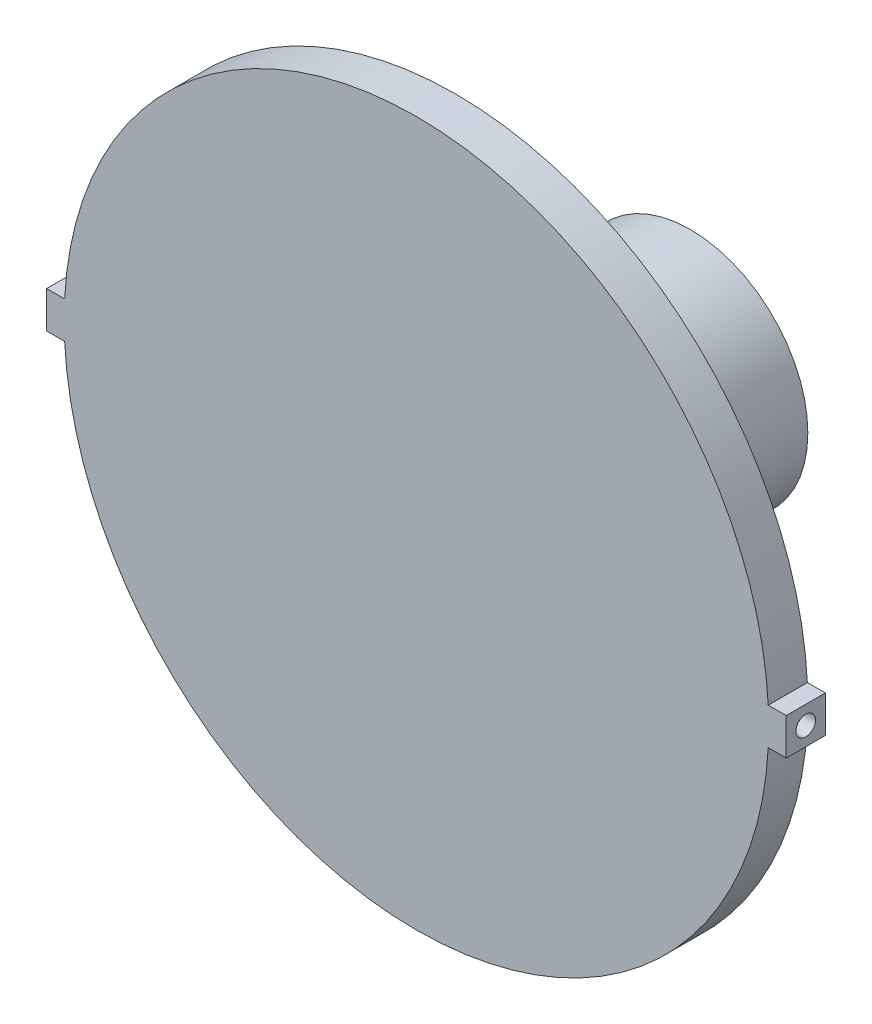
ISO-10303-21;
HEADER;
FILE_DESCRIPTION(('STEP AP214'),'2;1');
FILE_NAME('part.step','',(''),(''),'','','');
FILE_SCHEMA(('AUTOMOTIVE_DESIGN { 1 0 10303 214 1 1 1 1 }'));
ENDSEC;
DATA;
#1=APPLICATION_CONTEXT('core data for automotive mechanical design processes');
#2=APPLICATION_PROTOCOL_DEFINITION('international standard','automotive_design',2000,#1);
#3=PRODUCT_CONTEXT('',#1,'mechanical');
#4=PRODUCT('Part','Part','',(#3));
#5=PRODUCT_RELATED_PRODUCT_CATEGORY('part','',(#4));
#6=PRODUCT_DEFINITION_FORMATION('','',#4);
#7=PRODUCT_DEFINITION_CONTEXT('part definition',#1,'design');
#8=PRODUCT_DEFINITION('design','',#6,#7);
#9=PRODUCT_DEFINITION_SHAPE('','',#8);
#10=(LENGTH_UNIT() NAMED_UNIT(*) SI_UNIT(.MILLI.,.METRE.));
#11=(NAMED_UNIT(*) PLANE_ANGLE_UNIT() SI_UNIT($,.RADIAN.));
#12=(NAMED_UNIT(*) SI_UNIT($,.STERADIAN.) SOLID_ANGLE_UNIT());
#13=UNCERTAINTY_MEASURE_WITH_UNIT(LENGTH_MEASURE(1.E-05),#10,'distance_accuracy_value','');
#14=(GEOMETRIC_REPRESENTATION_CONTEXT(3) GLOBAL_UNCERTAINTY_ASSIGNED_CONTEXT((#13)) GLOBAL_UNIT_ASSIGNED_CONTEXT((#10,
#11,#12)) REPRESENTATION_CONTEXT('',''));
#15=CARTESIAN_POINT('',(0.,0.,0.));
#16=DIRECTION('',(0.,0.,1.));
#17=DIRECTION('',(1.,0.,0.));
#18=AXIS2_PLACEMENT_3D('',#15,#16,#17);
#19=CARTESIAN_POINT('',(0.,0.,-30.));
#20=DIRECTION('',(0.,0.,-1.));
#21=DIRECTION('',(-1.,0.,0.));
#22=AXIS2_PLACEMENT_3D('',#19,#20,#21);
#23=PLANE('',#22);
#24=CARTESIAN_POINT('',(0.,0.,-30.));
#25=DIRECTION('',(0.,0.,-1.));
#26=DIRECTION('',(-1.,0.,0.));
#27=AXIS2_PLACEMENT_3D('',#24,#25,#26);
#28=CIRCLE('',#27,15.);
#29=CARTESIAN_POINT('',(-15.,0.,-30.));
#30=VERTEX_POINT('',#29);
#31=EDGE_CURVE('E136',#30,#30,#28,.T.);
#32=ORIENTED_EDGE('',*,*,#31,.T.);
#33=EDGE_LOOP('',(#32));
#34=FACE_BOUND('',#33,.T.);
#35=CARTESIAN_POINT('',(0.,0.,-30.));
#36=DIRECTION('',(0.,0.,-1.));
#37=DIRECTION('',(-1.,0.,0.));
#38=AXIS2_PLACEMENT_3D('',#35,#36,#37);
#39=CIRCLE('',#38,4.);
#40=CARTESIAN_POINT('',(-4.,0.,-30.));
#41=VERTEX_POINT('',#40);
#42=EDGE_CURVE('E188',#41,#41,#39,.T.);
#43=ORIENTED_EDGE('',*,*,#42,.F.);
#44=EDGE_LOOP('',(#43));
#45=FACE_BOUND('',#44,.T.);
#46=ADVANCED_FACE('F34',(#34,#45),#23,.T.);
#47=CARTESIAN_POINT('',(0.,0.,0.));
#48=DIRECTION('',(0.,0.,1.));
#49=DIRECTION('',(1.,0.,0.));
#50=AXIS2_PLACEMENT_3D('',#47,#48,#49);
#51=PLANE('',#50);
#52=DIRECTION('',(1.,0.,0.));
#53=VECTOR('',#52,1.);
#54=CARTESIAN_POINT('',(-44.9384851980008,-2.35213692396208,0.));
#55=LINE('',#54,#53);
#56=CARTESIAN_POINT('',(-47.2384851980008,-2.35213692396208,0.));
#57=VERTEX_POINT('',#56);
#58=CARTESIAN_POINT('',(-44.9384851980008,-2.35213692396208,0.));
#59=VERTEX_POINT('',#58);
#60=EDGE_CURVE('E132',#57,#59,#55,.T.);
#61=ORIENTED_EDGE('',*,*,#60,.F.);
#62=DIRECTION('',(0.,-1.,0.));
#63=VECTOR('',#62,1.);
#64=CARTESIAN_POINT('',(-47.2384851980008,2.35213692396208,0.));
#65=LINE('',#64,#63);
#66=CARTESIAN_POINT('',(-47.2384851980008,2.35213692396208,0.));
#67=VERTEX_POINT('',#66);
#68=EDGE_CURVE('E86',#67,#57,#65,.T.);
#69=ORIENTED_EDGE('',*,*,#68,.F.);
#70=DIRECTION('',(-1.,0.,0.));
#71=VECTOR('',#70,1.);
#72=CARTESIAN_POINT('',(-44.9384851980008,2.35213692396208,0.));
#73=LINE('',#72,#71);
#74=CARTESIAN_POINT('',(-44.9384851980008,2.35213692396208,0.));
#75=VERTEX_POINT('',#74);
#76=EDGE_CURVE('E80',#75,#67,#73,.T.);
#77=ORIENTED_EDGE('',*,*,#76,.F.);
#78=CARTESIAN_POINT('',(0.,0.,0.));
#79=DIRECTION('',(0.,0.,1.));
#80=DIRECTION('',(1.,0.,0.));
#81=AXIS2_PLACEMENT_3D('',#78,#79,#80);
#82=CIRCLE('',#81,45.);
#83=CARTESIAN_POINT('',(44.9384851980008,2.35213692396235,0.));
#84=VERTEX_POINT('',#83);
#85=EDGE_CURVE('E122',#84,#75,#82,.T.);
#86=ORIENTED_EDGE('',*,*,#85,.F.);
#87=DIRECTION('',(-1.,0.,0.));
#88=VECTOR('',#87,1.);
#89=CARTESIAN_POINT('',(44.9384851980007,2.35213692396235,0.));
#90=LINE('',#89,#88);
#91=CARTESIAN_POINT('',(47.2384851980008,2.35213692396235,0.));
#92=VERTEX_POINT('',#91);
#93=EDGE_CURVE('E142',#92,#84,#90,.T.);
#94=ORIENTED_EDGE('',*,*,#93,.F.);
#95=DIRECTION('',(0.,1.,0.));
#96=VECTOR('',#95,1.);
#97=CARTESIAN_POINT('',(47.2384851980008,2.35213692396235,0.));
#98=LINE('',#97,#96);
#99=CARTESIAN_POINT('',(47.2384851980008,-2.35213692396182,0.));
#100=VERTEX_POINT('',#99);
#101=EDGE_CURVE('E140',#100,#92,#98,.T.);
#102=ORIENTED_EDGE('',*,*,#101,.F.);
#103=DIRECTION('',(1.,0.,0.));
#104=VECTOR('',#103,1.);
#105=CARTESIAN_POINT('',(44.9384851980008,-2.35213692396182,0.));
#106=LINE('',#105,#104);
#107=CARTESIAN_POINT('',(44.9384851980008,-2.35213692396182,0.));
#108=VERTEX_POINT('',#107);
#109=EDGE_CURVE('E138',#108,#100,#106,.T.);
#110=ORIENTED_EDGE('',*,*,#109,.F.);
#111=CARTESIAN_POINT('',(0.,0.,0.));
#112=DIRECTION('',(0.,0.,1.));
#113=DIRECTION('',(1.,0.,0.));
#114=AXIS2_PLACEMENT_3D('',#111,#112,#113);
#115=CIRCLE('',#114,45.);
#116=EDGE_CURVE('E135',#59,#108,#115,.T.);
#117=ORIENTED_EDGE('',*,*,#116,.F.);
#118=EDGE_LOOP('',(#61,#69,#77,#86,#94,#102,#110,#117));
#119=FACE_BOUND('',#118,.T.);
#120=CARTESIAN_POINT('',(0.,0.,0.));
#121=DIRECTION('',(0.,0.,1.));
#122=DIRECTION('',(1.,0.,0.));
#123=AXIS2_PLACEMENT_3D('',#120,#121,#122);
#124=CIRCLE('',#123,15.);
#125=CARTESIAN_POINT('',(15.,0.,0.));
#126=VERTEX_POINT('',#125);
#127=EDGE_CURVE('E11',#126,#126,#124,.F.);
#128=ORIENTED_EDGE('',*,*,#127,.F.);
#129=EDGE_LOOP('',(#128));
#130=FACE_BOUND('',#129,.T.);
#131=ADVANCED_FACE('F165',(#119,#130),#51,.F.);
#132=CARTESIAN_POINT('',(-44.9384851980008,-2.35213692396208,5.));
#133=DIRECTION('',(0.,1.,0.));
#134=DIRECTION('',(0.,0.,1.));
#135=AXIS2_PLACEMENT_3D('',#132,#133,#134);
#136=PLANE('',#135);
#137=ORIENTED_EDGE('',*,*,#60,.T.);
#138=DIRECTION('',(0.,0.,-1.));
#139=VECTOR('',#138,1.);
#140=CARTESIAN_POINT('',(-44.9384851980008,-2.35213692396208,5.));
#141=LINE('',#140,#139);
#142=CARTESIAN_POINT('',(-44.9384851980008,-2.35213692396208,5.));
#143=VERTEX_POINT('',#142);
#144=EDGE_CURVE('E43',#143,#59,#141,.T.);
#145=ORIENTED_EDGE('',*,*,#144,.F.);
#146=DIRECTION('',(1.,0.,0.));
#147=VECTOR('',#146,1.);
#148=CARTESIAN_POINT('',(-44.9384851980008,-2.35213692396208,5.));
#149=LINE('',#148,#147);
#150=CARTESIAN_POINT('',(-47.2384851980008,-2.35213692396208,5.));
#151=VERTEX_POINT('',#150);
#152=EDGE_CURVE('E147',#151,#143,#149,.T.);
#153=ORIENTED_EDGE('',*,*,#152,.F.);
#154=DIRECTION('',(0.,0.,-1.));
#155=VECTOR('',#154,1.);
#156=CARTESIAN_POINT('',(-47.2384851980008,-2.35213692396208,5.));
#157=LINE('',#156,#155);
#158=EDGE_CURVE('E128',#151,#57,#157,.T.);
#159=ORIENTED_EDGE('',*,*,#158,.T.);
#160=EDGE_LOOP('',(#137,#145,#153,#159));
#161=FACE_BOUND('',#160,.T.);
#162=ADVANCED_FACE('F36',(#161),#136,.F.);
#163=CARTESIAN_POINT('',(0.,0.,5.));
#164=DIRECTION('',(0.,0.,-1.));
#165=DIRECTION('',(-1.,0.,0.));
#166=AXIS2_PLACEMENT_3D('',#163,#164,#165);
#167=CYLINDRICAL_SURFACE('',#166,45.);
#168=ORIENTED_EDGE('',*,*,#116,.T.);
#169=DIRECTION('',(0.,0.,-1.));
#170=VECTOR('',#169,1.);
#171=CARTESIAN_POINT('',(44.9384851980008,-2.35213692396182,5.));
#172=LINE('',#171,#170);
#173=CARTESIAN_POINT('',(44.9384851980008,-2.35213692396182,5.));
#174=VERTEX_POINT('',#173);
#175=EDGE_CURVE('E157',#174,#108,#172,.T.);
#176=ORIENTED_EDGE('',*,*,#175,.F.);
#177=CARTESIAN_POINT('',(0.,0.,5.));
#178=DIRECTION('',(0.,0.,1.));
#179=DIRECTION('',(1.,0.,0.));
#180=AXIS2_PLACEMENT_3D('',#177,#178,#179);
#181=CIRCLE('',#180,45.);
#182=EDGE_CURVE('E95',#143,#174,#181,.T.);
#183=ORIENTED_EDGE('',*,*,#182,.F.);
#184=ORIENTED_EDGE('',*,*,#144,.T.);
#185=EDGE_LOOP('',(#168,#176,#183,#184));
#186=FACE_BOUND('',#185,.T.);
#187=ADVANCED_FACE('F160',(#186),#167,.T.);
#188=CARTESIAN_POINT('',(44.9384851980008,-2.35213692396182,5.));
#189=DIRECTION('',(0.,1.,0.));
#190=DIRECTION('',(0.,0.,1.));
#191=AXIS2_PLACEMENT_3D('',#188,#189,#190);
#192=PLANE('',#191);
#193=ORIENTED_EDGE('',*,*,#109,.T.);
#194=DIRECTION('',(0.,0.,-1.));
#195=VECTOR('',#194,1.);
#196=CARTESIAN_POINT('',(47.2384851980008,-2.35213692396182,5.));
#197=LINE('',#196,#195);
#198=CARTESIAN_POINT('',(47.2384851980008,-2.35213692396182,5.));
#199=VERTEX_POINT('',#198);
#200=EDGE_CURVE('E154',#199,#100,#197,.T.);
#201=ORIENTED_EDGE('',*,*,#200,.F.);
#202=DIRECTION('',(1.,0.,0.));
#203=VECTOR('',#202,1.);
#204=CARTESIAN_POINT('',(44.9384851980008,-2.35213692396182,5.));
#205=LINE('',#204,#203);
#206=EDGE_CURVE('E179',#174,#199,#205,.T.);
#207=ORIENTED_EDGE('',*,*,#206,.F.);
#208=ORIENTED_EDGE('',*,*,#175,.T.);
#209=EDGE_LOOP('',(#193,#201,#207,#208));
#210=FACE_BOUND('',#209,.T.);
#211=ADVANCED_FACE('F172',(#210),#192,.F.);
#212=CARTESIAN_POINT('',(47.2384851980008,2.35213692396235,5.));
#213=DIRECTION('',(-1.,0.,0.));
#214=DIRECTION('',(0.,0.,1.));
#215=AXIS2_PLACEMENT_3D('',#212,#213,#214);
#216=PLANE('',#215);
#217=CARTESIAN_POINT('',(47.2384851980008,0.,2.5));
#218=DIRECTION('',(1.,0.,0.));
#219=DIRECTION('',(0.,1.,0.));
#220=AXIS2_PLACEMENT_3D('',#217,#218,#219);
#221=CIRCLE('',#220,1.25);
#222=CARTESIAN_POINT('',(47.2384851980008,1.25,2.5));
#223=VERTEX_POINT('',#222);
#224=EDGE_CURVE('E194',#223,#223,#221,.T.);
#225=ORIENTED_EDGE('',*,*,#224,.F.);
#226=EDGE_LOOP('',(#225));
#227=FACE_BOUND('',#226,.T.);
#228=ORIENTED_EDGE('',*,*,#101,.T.);
#229=DIRECTION('',(0.,0.,-1.));
#230=VECTOR('',#229,1.);
#231=CARTESIAN_POINT('',(47.2384851980008,2.35213692396235,5.));
#232=LINE('',#231,#230);
#233=CARTESIAN_POINT('',(47.2384851980008,2.35213692396235,5.));
#234=VERTEX_POINT('',#233);
#235=EDGE_CURVE('E151',#234,#92,#232,.T.);
#236=ORIENTED_EDGE('',*,*,#235,.F.);
#237=DIRECTION('',(0.,1.,0.));
#238=VECTOR('',#237,1.);
#239=CARTESIAN_POINT('',(47.2384851980008,2.35213692396235,5.));
#240=LINE('',#239,#238);
#241=EDGE_CURVE('E178',#199,#234,#240,.T.);
#242=ORIENTED_EDGE('',*,*,#241,.F.);
#243=ORIENTED_EDGE('',*,*,#200,.T.);
#244=EDGE_LOOP('',(#228,#236,#242,#243));
#245=FACE_BOUND('',#244,.T.);
#246=ADVANCED_FACE('F176',(#227,#245),#216,.F.);
#247=CARTESIAN_POINT('',(44.9384851980007,2.35213692396235,5.));
#248=DIRECTION('',(0.,-1.,0.));
#249=DIRECTION('',(0.,0.,-1.));
#250=AXIS2_PLACEMENT_3D('',#247,#248,#249);
#251=PLANE('',#250);
#252=ORIENTED_EDGE('',*,*,#93,.T.);
#253=DIRECTION('',(0.,0.,-1.));
#254=VECTOR('',#253,1.);
#255=CARTESIAN_POINT('',(44.9384851980008,2.35213692396235,5.));
#256=LINE('',#255,#254);
#257=CARTESIAN_POINT('',(44.9384851980008,2.35213692396235,5.));
#258=VERTEX_POINT('',#257);
#259=EDGE_CURVE('E123',#258,#84,#256,.T.);
#260=ORIENTED_EDGE('',*,*,#259,.F.);
#261=DIRECTION('',(-1.,0.,0.));
#262=VECTOR('',#261,1.);
#263=CARTESIAN_POINT('',(44.9384851980007,2.35213692396235,5.));
#264=LINE('',#263,#262);
#265=EDGE_CURVE('E114',#234,#258,#264,.T.);
#266=ORIENTED_EDGE('',*,*,#265,.F.);
#267=ORIENTED_EDGE('',*,*,#235,.T.);
#268=EDGE_LOOP('',(#252,#260,#266,#267));
#269=FACE_BOUND('',#268,.T.);
#270=ADVANCED_FACE('F288',(#269),#251,.F.);
#271=CARTESIAN_POINT('',(0.,0.,5.));
#272=DIRECTION('',(0.,0.,-1.));
#273=DIRECTION('',(-1.,0.,0.));
#274=AXIS2_PLACEMENT_3D('',#271,#272,#273);
#275=CYLINDRICAL_SURFACE('',#274,45.);
#276=ORIENTED_EDGE('',*,*,#85,.T.);
#277=DIRECTION('',(0.,0.,-1.));
#278=VECTOR('',#277,1.);
#279=CARTESIAN_POINT('',(-44.9384851980008,2.35213692396208,5.));
#280=LINE('',#279,#278);
#281=CARTESIAN_POINT('',(-44.9384851980008,2.35213692396208,5.));
#282=VERTEX_POINT('',#281);
#283=EDGE_CURVE('E119',#282,#75,#280,.T.);
#284=ORIENTED_EDGE('',*,*,#283,.F.);
#285=CARTESIAN_POINT('',(0.,0.,5.));
#286=DIRECTION('',(0.,0.,1.));
#287=DIRECTION('',(1.,0.,0.));
#288=AXIS2_PLACEMENT_3D('',#285,#286,#287);
#289=CIRCLE('',#288,45.);
#290=EDGE_CURVE('E108',#258,#282,#289,.T.);
#291=ORIENTED_EDGE('',*,*,#290,.F.);
#292=ORIENTED_EDGE('',*,*,#259,.T.);
#293=EDGE_LOOP('',(#276,#284,#291,#292));
#294=FACE_BOUND('',#293,.T.);
#295=ADVANCED_FACE('F120',(#294),#275,.T.);
#296=CARTESIAN_POINT('',(-44.9384851980008,2.35213692396208,5.));
#297=DIRECTION('',(0.,-1.,0.));
#298=DIRECTION('',(1.,0.,0.));
#299=AXIS2_PLACEMENT_3D('',#296,#297,#298);
#300=PLANE('',#299);
#301=ORIENTED_EDGE('',*,*,#76,.T.);
#302=DIRECTION('',(0.,0.,-1.));
#303=VECTOR('',#302,1.);
#304=CARTESIAN_POINT('',(-47.2384851980008,2.35213692396208,5.));
#305=LINE('',#304,#303);
#306=CARTESIAN_POINT('',(-47.2384851980008,2.35213692396208,5.));
#307=VERTEX_POINT('',#306);
#308=EDGE_CURVE('E124',#307,#67,#305,.T.);
#309=ORIENTED_EDGE('',*,*,#308,.F.);
#310=DIRECTION('',(-1.,0.,0.));
#311=VECTOR('',#310,1.);
#312=CARTESIAN_POINT('',(-44.9384851980008,2.35213692396208,5.));
#313=LINE('',#312,#311);
#314=EDGE_CURVE('E112',#282,#307,#313,.T.);
#315=ORIENTED_EDGE('',*,*,#314,.F.);
#316=ORIENTED_EDGE('',*,*,#283,.T.);
#317=EDGE_LOOP('',(#301,#309,#315,#316));
#318=FACE_BOUND('',#317,.T.);
#319=ADVANCED_FACE('F126',(#318),#300,.F.);
#320=CARTESIAN_POINT('',(-47.2384851980008,2.35213692396208,5.));
#321=DIRECTION('',(1.,0.,0.));
#322=DIRECTION('',(0.,0.,-1.));
#323=AXIS2_PLACEMENT_3D('',#320,#321,#322);
#324=PLANE('',#323);
#325=CARTESIAN_POINT('',(-47.2384851980008,0.,2.5));
#326=DIRECTION('',(-1.,0.,0.));
#327=DIRECTION('',(0.,0.,1.));
#328=AXIS2_PLACEMENT_3D('',#325,#326,#327);
#329=CIRCLE('',#328,1.25);
#330=CARTESIAN_POINT('',(-47.2384851980008,0.,3.75));
#331=VERTEX_POINT('',#330);
#332=EDGE_CURVE('E200',#331,#331,#329,.T.);
#333=ORIENTED_EDGE('',*,*,#332,.F.);
#334=EDGE_LOOP('',(#333));
#335=FACE_BOUND('',#334,.T.);
#336=ORIENTED_EDGE('',*,*,#68,.T.);
#337=ORIENTED_EDGE('',*,*,#158,.F.);
#338=DIRECTION('',(0.,-1.,0.));
#339=VECTOR('',#338,1.);
#340=CARTESIAN_POINT('',(-47.2384851980008,2.35213692396208,5.));
#341=LINE('',#340,#339);
#342=EDGE_CURVE('E51',#307,#151,#341,.T.);
#343=ORIENTED_EDGE('',*,*,#342,.F.);
#344=ORIENTED_EDGE('',*,*,#308,.T.);
#345=EDGE_LOOP('',(#336,#337,#343,#344));
#346=FACE_BOUND('',#345,.T.);
#347=ADVANCED_FACE('F215',(#335,#346),#324,.F.);
#348=CARTESIAN_POINT('',(0.,0.,5.));
#349=DIRECTION('',(0.,0.,1.));
#350=DIRECTION('',(1.,0.,0.));
#351=AXIS2_PLACEMENT_3D('',#348,#349,#350);
#352=PLANE('',#351);
#353=ORIENTED_EDGE('',*,*,#152,.T.);
#354=ORIENTED_EDGE('',*,*,#182,.T.);
#355=ORIENTED_EDGE('',*,*,#206,.T.);
#356=ORIENTED_EDGE('',*,*,#241,.T.);
#357=ORIENTED_EDGE('',*,*,#265,.T.);
#358=ORIENTED_EDGE('',*,*,#290,.T.);
#359=ORIENTED_EDGE('',*,*,#314,.T.);
#360=ORIENTED_EDGE('',*,*,#342,.T.);
#361=EDGE_LOOP('',(#353,#354,#355,#356,#357,#358,#359,#360));
#362=FACE_BOUND('',#361,.T.);
#363=ADVANCED_FACE('F110',(#362),#352,.T.);
#364=CARTESIAN_POINT('',(0.,0.,-30.));
#365=DIRECTION('',(0.,0.,1.));
#366=DIRECTION('',(1.,0.,0.));
#367=AXIS2_PLACEMENT_3D('',#364,#365,#366);
#368=CYLINDRICAL_SURFACE('',#367,15.);
#369=ORIENTED_EDGE('',*,*,#31,.F.);
#370=EDGE_LOOP('',(#369));
#371=FACE_BOUND('',#370,.T.);
#372=ORIENTED_EDGE('',*,*,#127,.T.);
#373=EDGE_LOOP('',(#372));
#374=FACE_BOUND('',#373,.T.);
#375=ADVANCED_FACE('F222',(#371,#374),#368,.T.);
#376=CARTESIAN_POINT('',(0.,0.,-36.9));
#377=DIRECTION('',(0.,0.,1.));
#378=DIRECTION('',(1.,0.,0.));
#379=AXIS2_PLACEMENT_3D('',#376,#377,#378);
#380=CYLINDRICAL_SURFACE('',#379,4.);
#381=CARTESIAN_POINT('',(0.,0.,-36.9));
#382=DIRECTION('',(0.,0.,-1.));
#383=DIRECTION('',(-1.,0.,0.));
#384=AXIS2_PLACEMENT_3D('',#381,#382,#383);
#385=CIRCLE('',#384,4.);
#386=CARTESIAN_POINT('',(-4.,0.,-36.9));
#387=VERTEX_POINT('',#386);
#388=EDGE_CURVE('E187',#387,#387,#385,.T.);
#389=ORIENTED_EDGE('',*,*,#388,.F.);
#390=EDGE_LOOP('',(#389));
#391=FACE_BOUND('',#390,.T.);
#392=ORIENTED_EDGE('',*,*,#42,.T.);
#393=EDGE_LOOP('',(#392));
#394=FACE_BOUND('',#393,.T.);
#395=ADVANCED_FACE('F235',(#391,#394),#380,.T.);
#396=CARTESIAN_POINT('',(0.,0.,-36.9));
#397=DIRECTION('',(0.,0.,-1.));
#398=DIRECTION('',(-1.,0.,0.));
#399=AXIS2_PLACEMENT_3D('',#396,#397,#398);
#400=PLANE('',#399);
#401=ORIENTED_EDGE('',*,*,#388,.T.);
#402=EDGE_LOOP('',(#401));
#403=FACE_BOUND('',#402,.T.);
#404=ADVANCED_FACE('F242',(#403),#400,.T.);
#405=CARTESIAN_POINT('',(42.2384851980008,0.,2.5));
#406=DIRECTION('',(1.,0.,0.));
#407=DIRECTION('',(0.,1.,0.));
#408=AXIS2_PLACEMENT_3D('',#405,#406,#407);
#409=CYLINDRICAL_SURFACE('',#408,1.25);
#410=CARTESIAN_POINT('',(42.2384851980008,0.,2.5));
#411=DIRECTION('',(1.,0.,0.));
#412=DIRECTION('',(0.,1.,0.));
#413=AXIS2_PLACEMENT_3D('',#410,#411,#412);
#414=CIRCLE('',#413,1.25);
#415=CARTESIAN_POINT('',(42.2384851980008,1.24999999999997,2.5));
#416=VERTEX_POINT('',#415);
#417=EDGE_CURVE('E191',#416,#416,#414,.T.);
#418=ORIENTED_EDGE('',*,*,#417,.F.);
#419=EDGE_LOOP('',(#418));
#420=FACE_BOUND('',#419,.T.);
#421=ORIENTED_EDGE('',*,*,#224,.T.);
#422=EDGE_LOOP('',(#421));
#423=FACE_BOUND('',#422,.T.);
#424=ADVANCED_FACE('F250',(#420,#423),#409,.F.);
#425=CARTESIAN_POINT('',(42.2384851980008,0.,2.5));
#426=DIRECTION('',(1.,0.,0.));
#427=DIRECTION('',(0.,1.,0.));
#428=AXIS2_PLACEMENT_3D('',#425,#426,#427);
#429=PLANE('',#428);
#430=ORIENTED_EDGE('',*,*,#417,.T.);
#431=EDGE_LOOP('',(#430));
#432=FACE_BOUND('',#431,.T.);
#433=ADVANCED_FACE('F211',(#432),#429,.T.);
#434=CARTESIAN_POINT('',(-42.2384851980008,0.,2.5));
#435=DIRECTION('',(-1.,0.,0.));
#436=DIRECTION('',(0.,0.,1.));
#437=AXIS2_PLACEMENT_3D('',#434,#435,#436);
#438=CYLINDRICAL_SURFACE('',#437,1.25);
#439=CARTESIAN_POINT('',(-42.2384851980008,0.,2.5));
#440=DIRECTION('',(-1.,0.,0.));
#441=DIRECTION('',(0.,0.,1.));
#442=AXIS2_PLACEMENT_3D('',#439,#440,#441);
#443=CIRCLE('',#442,1.25);
#444=CARTESIAN_POINT('',(-42.2384851980008,0.,3.75));
#445=VERTEX_POINT('',#444);
#446=EDGE_CURVE('E197',#445,#445,#443,.T.);
#447=ORIENTED_EDGE('',*,*,#446,.F.);
#448=EDGE_LOOP('',(#447));
#449=FACE_BOUND('',#448,.T.);
#450=ORIENTED_EDGE('',*,*,#332,.T.);
#451=EDGE_LOOP('',(#450));
#452=FACE_BOUND('',#451,.T.);
#453=ADVANCED_FACE('F208',(#449,#452),#438,.F.);
#454=CARTESIAN_POINT('',(-42.2384851980008,0.,2.5));
#455=DIRECTION('',(-1.,0.,0.));
#456=DIRECTION('',(0.,0.,1.));
#457=AXIS2_PLACEMENT_3D('',#454,#455,#456);
#458=PLANE('',#457);
#459=ORIENTED_EDGE('',*,*,#446,.T.);
#460=EDGE_LOOP('',(#459));
#461=FACE_BOUND('',#460,.T.);
#462=ADVANCED_FACE('F206',(#461),#458,.T.);
#463=CLOSED_SHELL('',(#46,#131,#162,#187,#211,#246,#270,#295,#319,#347,#363,#375,#395,#404,#424,
#433,#453,#462));
#464=MANIFOLD_SOLID_BREP('B2',#463);
#465=ADVANCED_BREP_SHAPE_REPRESENTATION('',(#18,#464),#14);
#466=SHAPE_DEFINITION_REPRESENTATION(#9,#465);
ENDSEC;
END-ISO-10303-21;
